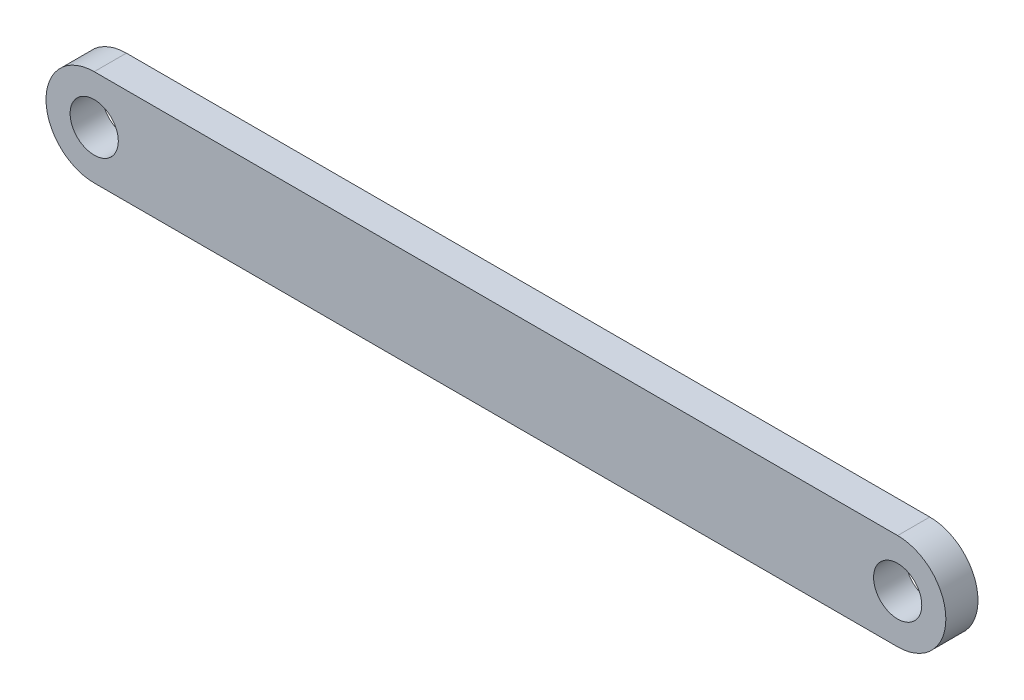
ISO-10303-21;
HEADER;
FILE_DESCRIPTION(('STEP AP214'),'2;1');
FILE_NAME('part.step','',(''),(''),'','','');
FILE_SCHEMA(('AUTOMOTIVE_DESIGN { 1 0 10303 214 1 1 1 1 }'));
ENDSEC;
DATA;
#1=APPLICATION_CONTEXT('core data for automotive mechanical design processes');
#2=APPLICATION_PROTOCOL_DEFINITION('international standard','automotive_design',2000,#1);
#3=PRODUCT_CONTEXT('',#1,'mechanical');
#4=PRODUCT('Part','Part','',(#3));
#5=PRODUCT_RELATED_PRODUCT_CATEGORY('part','',(#4));
#6=PRODUCT_DEFINITION_FORMATION('','',#4);
#7=PRODUCT_DEFINITION_CONTEXT('part definition',#1,'design');
#8=PRODUCT_DEFINITION('design','',#6,#7);
#9=PRODUCT_DEFINITION_SHAPE('','',#8);
#10=(LENGTH_UNIT() NAMED_UNIT(*) SI_UNIT(.MILLI.,.METRE.));
#11=(NAMED_UNIT(*) PLANE_ANGLE_UNIT() SI_UNIT($,.RADIAN.));
#12=(NAMED_UNIT(*) SI_UNIT($,.STERADIAN.) SOLID_ANGLE_UNIT());
#13=UNCERTAINTY_MEASURE_WITH_UNIT(LENGTH_MEASURE(1.E-05),#10,'distance_accuracy_value','');
#14=(GEOMETRIC_REPRESENTATION_CONTEXT(3) GLOBAL_UNCERTAINTY_ASSIGNED_CONTEXT((#13)) GLOBAL_UNIT_ASSIGNED_CONTEXT((#10,
#11,#12)) REPRESENTATION_CONTEXT('',''));
#15=CARTESIAN_POINT('',(0.,0.,0.));
#16=DIRECTION('',(0.,0.,1.));
#17=DIRECTION('',(1.,0.,0.));
#18=AXIS2_PLACEMENT_3D('',#15,#16,#17);
#19=CARTESIAN_POINT('',(-25.,0.,2.));
#20=DIRECTION('',(0.,0.,1.));
#21=DIRECTION('',(1.,0.,0.));
#22=AXIS2_PLACEMENT_3D('',#19,#20,#21);
#23=PLANE('',#22);
#24=CARTESIAN_POINT('',(-25.,0.,2.));
#25=DIRECTION('',(0.,0.,1.));
#26=DIRECTION('',(1.,0.,0.));
#27=AXIS2_PLACEMENT_3D('',#24,#25,#26);
#28=CIRCLE('',#27,1.5);
#29=CARTESIAN_POINT('',(-23.5,0.,2.));
#30=VERTEX_POINT('',#29);
#31=EDGE_CURVE('E115',#30,#30,#28,.T.);
#32=ORIENTED_EDGE('',*,*,#31,.F.);
#33=EDGE_LOOP('',(#32));
#34=FACE_BOUND('',#33,.T.);
#35=CARTESIAN_POINT('',(-25.,0.,2.));
#36=DIRECTION('',(0.,0.,1.));
#37=DIRECTION('',(1.,0.,0.));
#38=AXIS2_PLACEMENT_3D('',#35,#36,#37);
#39=CIRCLE('',#38,3.);
#40=CARTESIAN_POINT('',(-25.,3.,2.));
#41=VERTEX_POINT('',#40);
#42=CARTESIAN_POINT('',(-25.,-3.,2.));
#43=VERTEX_POINT('',#42);
#44=EDGE_CURVE('E95',#41,#43,#39,.T.);
#45=ORIENTED_EDGE('',*,*,#44,.T.);
#46=DIRECTION('',(1.,0.,0.));
#47=VECTOR('',#46,1.);
#48=CARTESIAN_POINT('',(-25.,-3.,2.));
#49=LINE('',#48,#47);
#50=CARTESIAN_POINT('',(25.,-2.99999999999999,2.));
#51=VERTEX_POINT('',#50);
#52=EDGE_CURVE('E89',#43,#51,#49,.T.);
#53=ORIENTED_EDGE('',*,*,#52,.T.);
#54=CARTESIAN_POINT('',(25.,0.,2.));
#55=DIRECTION('',(0.,0.,1.));
#56=DIRECTION('',(1.,0.,0.));
#57=AXIS2_PLACEMENT_3D('',#54,#55,#56);
#58=CIRCLE('',#57,3.);
#59=CARTESIAN_POINT('',(25.,3.00000000000001,2.));
#60=VERTEX_POINT('',#59);
#61=EDGE_CURVE('E93',#51,#60,#58,.T.);
#62=ORIENTED_EDGE('',*,*,#61,.T.);
#63=DIRECTION('',(-1.,0.,0.));
#64=VECTOR('',#63,1.);
#65=CARTESIAN_POINT('',(-25.,3.,2.));
#66=LINE('',#65,#64);
#67=EDGE_CURVE('E56',#60,#41,#66,.T.);
#68=ORIENTED_EDGE('',*,*,#67,.T.);
#69=EDGE_LOOP('',(#45,#53,#62,#68));
#70=FACE_BOUND('',#69,.T.);
#71=CARTESIAN_POINT('',(25.,0.,2.));
#72=DIRECTION('',(0.,0.,1.));
#73=DIRECTION('',(1.,0.,0.));
#74=AXIS2_PLACEMENT_3D('',#71,#72,#73);
#75=CIRCLE('',#74,1.5);
#76=CARTESIAN_POINT('',(26.5,0.,2.));
#77=VERTEX_POINT('',#76);
#78=EDGE_CURVE('E134',#77,#77,#75,.T.);
#79=ORIENTED_EDGE('',*,*,#78,.F.);
#80=EDGE_LOOP('',(#79));
#81=FACE_BOUND('',#80,.T.);
#82=ADVANCED_FACE('F39',(#34,#70,#81),#23,.T.);
#83=CARTESIAN_POINT('',(-25.,0.,0.));
#84=DIRECTION('',(0.,0.,1.));
#85=DIRECTION('',(1.,0.,0.));
#86=AXIS2_PLACEMENT_3D('',#83,#84,#85);
#87=PLANE('',#86);
#88=CARTESIAN_POINT('',(-25.,0.,0.));
#89=DIRECTION('',(0.,0.,1.));
#90=DIRECTION('',(1.,0.,0.));
#91=AXIS2_PLACEMENT_3D('',#88,#89,#90);
#92=CIRCLE('',#91,3.);
#93=CARTESIAN_POINT('',(-25.,3.,0.));
#94=VERTEX_POINT('',#93);
#95=CARTESIAN_POINT('',(-25.,-3.,0.));
#96=VERTEX_POINT('',#95);
#97=EDGE_CURVE('E112',#94,#96,#92,.T.);
#98=ORIENTED_EDGE('',*,*,#97,.F.);
#99=DIRECTION('',(-1.,0.,0.));
#100=VECTOR('',#99,1.);
#101=CARTESIAN_POINT('',(-25.,3.,0.));
#102=LINE('',#101,#100);
#103=CARTESIAN_POINT('',(25.,3.00000000000001,0.));
#104=VERTEX_POINT('',#103);
#105=EDGE_CURVE('E82',#104,#94,#102,.T.);
#106=ORIENTED_EDGE('',*,*,#105,.F.);
#107=CARTESIAN_POINT('',(25.,0.,0.));
#108=DIRECTION('',(0.,0.,1.));
#109=DIRECTION('',(1.,0.,0.));
#110=AXIS2_PLACEMENT_3D('',#107,#108,#109);
#111=CIRCLE('',#110,3.);
#112=CARTESIAN_POINT('',(25.,-2.99999999999999,0.));
#113=VERTEX_POINT('',#112);
#114=EDGE_CURVE('E76',#113,#104,#111,.T.);
#115=ORIENTED_EDGE('',*,*,#114,.F.);
#116=DIRECTION('',(1.,0.,0.));
#117=VECTOR('',#116,1.);
#118=CARTESIAN_POINT('',(-25.,-3.,0.));
#119=LINE('',#118,#117);
#120=EDGE_CURVE('E100',#96,#113,#119,.T.);
#121=ORIENTED_EDGE('',*,*,#120,.F.);
#122=EDGE_LOOP('',(#98,#106,#115,#121));
#123=FACE_BOUND('',#122,.T.);
#124=CARTESIAN_POINT('',(-25.,0.,0.));
#125=DIRECTION('',(0.,0.,1.));
#126=DIRECTION('',(1.,0.,0.));
#127=AXIS2_PLACEMENT_3D('',#124,#125,#126);
#128=CIRCLE('',#127,1.5);
#129=CARTESIAN_POINT('',(-23.5,0.,0.));
#130=VERTEX_POINT('',#129);
#131=EDGE_CURVE('E131',#130,#130,#128,.T.);
#132=ORIENTED_EDGE('',*,*,#131,.T.);
#133=EDGE_LOOP('',(#132));
#134=FACE_BOUND('',#133,.T.);
#135=CARTESIAN_POINT('',(25.,0.,0.));
#136=DIRECTION('',(0.,0.,1.));
#137=DIRECTION('',(1.,0.,0.));
#138=AXIS2_PLACEMENT_3D('',#135,#136,#137);
#139=CIRCLE('',#138,1.5);
#140=CARTESIAN_POINT('',(26.5,0.,0.));
#141=VERTEX_POINT('',#140);
#142=EDGE_CURVE('E137',#141,#141,#139,.T.);
#143=ORIENTED_EDGE('',*,*,#142,.T.);
#144=EDGE_LOOP('',(#143));
#145=FACE_BOUND('',#144,.T.);
#146=ADVANCED_FACE('F127',(#123,#134,#145),#87,.F.);
#147=CARTESIAN_POINT('',(-25.,0.,2.));
#148=DIRECTION('',(0.,0.,-1.));
#149=DIRECTION('',(-1.,0.,0.));
#150=AXIS2_PLACEMENT_3D('',#147,#148,#149);
#151=CYLINDRICAL_SURFACE('',#150,3.);
#152=ORIENTED_EDGE('',*,*,#97,.T.);
#153=DIRECTION('',(0.,0.,-1.));
#154=VECTOR('',#153,1.);
#155=CARTESIAN_POINT('',(-25.,-3.,2.));
#156=LINE('',#155,#154);
#157=EDGE_CURVE('E11',#43,#96,#156,.T.);
#158=ORIENTED_EDGE('',*,*,#157,.F.);
#159=ORIENTED_EDGE('',*,*,#44,.F.);
#160=DIRECTION('',(0.,0.,-1.));
#161=VECTOR('',#160,1.);
#162=CARTESIAN_POINT('',(-25.,3.,2.));
#163=LINE('',#162,#161);
#164=EDGE_CURVE('E108',#41,#94,#163,.T.);
#165=ORIENTED_EDGE('',*,*,#164,.T.);
#166=EDGE_LOOP('',(#152,#158,#159,#165));
#167=FACE_BOUND('',#166,.T.);
#168=ADVANCED_FACE('F41',(#167),#151,.T.);
#169=CARTESIAN_POINT('',(-25.,-3.,2.));
#170=DIRECTION('',(0.,1.,0.));
#171=DIRECTION('',(-1.,0.,0.));
#172=AXIS2_PLACEMENT_3D('',#169,#170,#171);
#173=PLANE('',#172);
#174=ORIENTED_EDGE('',*,*,#120,.T.);
#175=DIRECTION('',(0.,0.,-1.));
#176=VECTOR('',#175,1.);
#177=CARTESIAN_POINT('',(25.,-2.99999999999999,2.));
#178=LINE('',#177,#176);
#179=EDGE_CURVE('E48',#51,#113,#178,.T.);
#180=ORIENTED_EDGE('',*,*,#179,.F.);
#181=ORIENTED_EDGE('',*,*,#52,.F.);
#182=ORIENTED_EDGE('',*,*,#157,.T.);
#183=EDGE_LOOP('',(#174,#180,#181,#182));
#184=FACE_BOUND('',#183,.T.);
#185=ADVANCED_FACE('F99',(#184),#173,.F.);
#186=CARTESIAN_POINT('',(25.,0.,2.));
#187=DIRECTION('',(0.,0.,-1.));
#188=DIRECTION('',(-1.,0.,0.));
#189=AXIS2_PLACEMENT_3D('',#186,#187,#188);
#190=CYLINDRICAL_SURFACE('',#189,3.);
#191=ORIENTED_EDGE('',*,*,#114,.T.);
#192=DIRECTION('',(0.,0.,-1.));
#193=VECTOR('',#192,1.);
#194=CARTESIAN_POINT('',(25.,3.00000000000001,2.));
#195=LINE('',#194,#193);
#196=EDGE_CURVE('E102',#60,#104,#195,.T.);
#197=ORIENTED_EDGE('',*,*,#196,.F.);
#198=ORIENTED_EDGE('',*,*,#61,.F.);
#199=ORIENTED_EDGE('',*,*,#179,.T.);
#200=EDGE_LOOP('',(#191,#197,#198,#199));
#201=FACE_BOUND('',#200,.T.);
#202=ADVANCED_FACE('F103',(#201),#190,.T.);
#203=CARTESIAN_POINT('',(-25.,3.,2.));
#204=DIRECTION('',(0.,-1.,0.));
#205=DIRECTION('',(1.,0.,0.));
#206=AXIS2_PLACEMENT_3D('',#203,#204,#205);
#207=PLANE('',#206);
#208=ORIENTED_EDGE('',*,*,#105,.T.);
#209=ORIENTED_EDGE('',*,*,#164,.F.);
#210=ORIENTED_EDGE('',*,*,#67,.F.);
#211=ORIENTED_EDGE('',*,*,#196,.T.);
#212=EDGE_LOOP('',(#208,#209,#210,#211));
#213=FACE_BOUND('',#212,.T.);
#214=ADVANCED_FACE('F124',(#213),#207,.F.);
#215=CARTESIAN_POINT('',(-25.,0.,2.));
#216=DIRECTION('',(0.,0.,-1.));
#217=DIRECTION('',(-1.,0.,0.));
#218=AXIS2_PLACEMENT_3D('',#215,#216,#217);
#219=CYLINDRICAL_SURFACE('',#218,1.5);
#220=ORIENTED_EDGE('',*,*,#31,.T.);
#221=EDGE_LOOP('',(#220));
#222=FACE_BOUND('',#221,.T.);
#223=ORIENTED_EDGE('',*,*,#131,.F.);
#224=EDGE_LOOP('',(#223));
#225=FACE_BOUND('',#224,.T.);
#226=ADVANCED_FACE('F155',(#222,#225),#219,.F.);
#227=CARTESIAN_POINT('',(25.,0.,2.));
#228=DIRECTION('',(0.,0.,-1.));
#229=DIRECTION('',(-1.,0.,0.));
#230=AXIS2_PLACEMENT_3D('',#227,#228,#229);
#231=CYLINDRICAL_SURFACE('',#230,1.5);
#232=ORIENTED_EDGE('',*,*,#78,.T.);
#233=EDGE_LOOP('',(#232));
#234=FACE_BOUND('',#233,.T.);
#235=ORIENTED_EDGE('',*,*,#142,.F.);
#236=EDGE_LOOP('',(#235));
#237=FACE_BOUND('',#236,.T.);
#238=ADVANCED_FACE('F144',(#234,#237),#231,.F.);
#239=CLOSED_SHELL('',(#82,#146,#168,#185,#202,#214,#226,#238));
#240=MANIFOLD_SOLID_BREP('B2',#239);
#241=ADVANCED_BREP_SHAPE_REPRESENTATION('',(#18,#240),#14);
#242=SHAPE_DEFINITION_REPRESENTATION(#9,#241);
ENDSEC;
END-ISO-10303-21;
